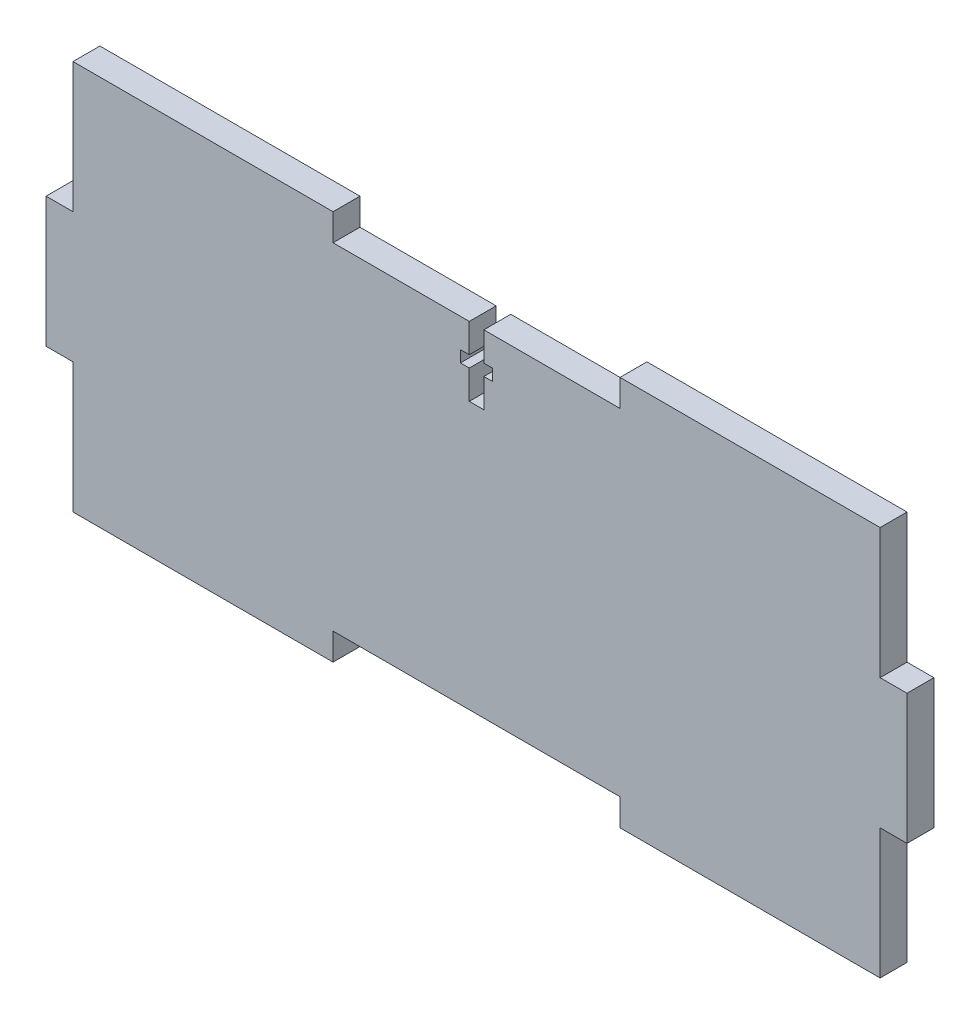
ISO-10303-21;
HEADER;
FILE_DESCRIPTION(('STEP AP214'),'2;1');
FILE_NAME('part.step','',(''),(''),'','','');
FILE_SCHEMA(('AUTOMOTIVE_DESIGN { 1 0 10303 214 1 1 1 1 }'));
ENDSEC;
DATA;
#1=APPLICATION_CONTEXT('core data for automotive mechanical design processes');
#2=APPLICATION_PROTOCOL_DEFINITION('international standard','automotive_design',2000,#1);
#3=PRODUCT_CONTEXT('',#1,'mechanical');
#4=PRODUCT('Part','Part','',(#3));
#5=PRODUCT_RELATED_PRODUCT_CATEGORY('part','',(#4));
#6=PRODUCT_DEFINITION_FORMATION('','',#4);
#7=PRODUCT_DEFINITION_CONTEXT('part definition',#1,'design');
#8=PRODUCT_DEFINITION('design','',#6,#7);
#9=PRODUCT_DEFINITION_SHAPE('','',#8);
#10=(LENGTH_UNIT() NAMED_UNIT(*) SI_UNIT(.MILLI.,.METRE.));
#11=(NAMED_UNIT(*) PLANE_ANGLE_UNIT() SI_UNIT($,.RADIAN.));
#12=(NAMED_UNIT(*) SI_UNIT($,.STERADIAN.) SOLID_ANGLE_UNIT());
#13=UNCERTAINTY_MEASURE_WITH_UNIT(LENGTH_MEASURE(1.E-05),#10,'distance_accuracy_value','');
#14=(GEOMETRIC_REPRESENTATION_CONTEXT(3) GLOBAL_UNCERTAINTY_ASSIGNED_CONTEXT((#13)) GLOBAL_UNIT_ASSIGNED_CONTEXT((#10,
#11,#12)) REPRESENTATION_CONTEXT('',''));
#15=CARTESIAN_POINT('',(0.,0.,0.));
#16=DIRECTION('',(0.,0.,1.));
#17=DIRECTION('',(1.,0.,0.));
#18=AXIS2_PLACEMENT_3D('',#15,#16,#17);
#19=CARTESIAN_POINT('',(-81.28,-36.83,5.08));
#20=DIRECTION('',(0.,1.,0.));
#21=DIRECTION('',(0.,0.,1.));
#22=AXIS2_PLACEMENT_3D('',#19,#20,#21);
#23=PLANE('',#22);
#24=DIRECTION('',(0.,0.,-1.));
#25=VECTOR('',#24,1.);
#26=CARTESIAN_POINT('',(-76.2,-36.83,5.08));
#27=LINE('',#26,#25);
#28=CARTESIAN_POINT('',(-76.2,-36.83,5.08));
#29=VERTEX_POINT('',#28);
#30=CARTESIAN_POINT('',(-76.2,-36.83,0.));
#31=VERTEX_POINT('',#30);
#32=EDGE_CURVE('E375',#29,#31,#27,.T.);
#33=ORIENTED_EDGE('',*,*,#32,.T.);
#34=DIRECTION('',(1.,0.,0.));
#35=VECTOR('',#34,1.);
#36=CARTESIAN_POINT('',(-81.28,-36.83,0.));
#37=LINE('',#36,#35);
#38=CARTESIAN_POINT('',(-27.0933333333333,-36.83,0.));
#39=VERTEX_POINT('',#38);
#40=EDGE_CURVE('E284',#31,#39,#37,.T.);
#41=ORIENTED_EDGE('',*,*,#40,.T.);
#42=DIRECTION('',(0.,0.,1.));
#43=VECTOR('',#42,1.);
#44=CARTESIAN_POINT('',(-27.0933333333333,-36.83,0.));
#45=LINE('',#44,#43);
#46=CARTESIAN_POINT('',(-27.0933333333333,-36.83,5.08));
#47=VERTEX_POINT('',#46);
#48=EDGE_CURVE('E340',#39,#47,#45,.T.);
#49=ORIENTED_EDGE('',*,*,#48,.T.);
#50=DIRECTION('',(1.,0.,0.));
#51=VECTOR('',#50,1.);
#52=CARTESIAN_POINT('',(-81.28,-36.83,5.08));
#53=LINE('',#52,#51);
#54=EDGE_CURVE('E268',#29,#47,#53,.T.);
#55=ORIENTED_EDGE('',*,*,#54,.F.);
#56=EDGE_LOOP('',(#33,#41,#49,#55));
#57=FACE_BOUND('',#56,.T.);
#58=ADVANCED_FACE('F33',(#57),#23,.F.);
#59=CARTESIAN_POINT('',(-81.28,36.83,5.08));
#60=DIRECTION('',(0.,-1.,0.));
#61=DIRECTION('',(0.,0.,-1.));
#62=AXIS2_PLACEMENT_3D('',#59,#60,#61);
#63=PLANE('',#62);
#64=DIRECTION('',(0.,0.,1.));
#65=VECTOR('',#64,1.);
#66=CARTESIAN_POINT('',(-76.2,36.83,5.08));
#67=LINE('',#66,#65);
#68=CARTESIAN_POINT('',(-76.2,36.83,0.));
#69=VERTEX_POINT('',#68);
#70=CARTESIAN_POINT('',(-76.2,36.83,5.08));
#71=VERTEX_POINT('',#70);
#72=EDGE_CURVE('E366',#69,#71,#67,.T.);
#73=ORIENTED_EDGE('',*,*,#72,.T.);
#74=DIRECTION('',(-1.,0.,0.));
#75=VECTOR('',#74,1.);
#76=CARTESIAN_POINT('',(-81.28,36.83,5.08));
#77=LINE('',#76,#75);
#78=CARTESIAN_POINT('',(-27.0933333333333,36.83,5.08));
#79=VERTEX_POINT('',#78);
#80=EDGE_CURVE('E270',#79,#71,#77,.T.);
#81=ORIENTED_EDGE('',*,*,#80,.F.);
#82=DIRECTION('',(0.,0.,1.));
#83=VECTOR('',#82,1.);
#84=CARTESIAN_POINT('',(-27.0933333333333,36.83,0.));
#85=LINE('',#84,#83);
#86=CARTESIAN_POINT('',(-27.0933333333333,36.83,0.));
#87=VERTEX_POINT('',#86);
#88=EDGE_CURVE('E279',#87,#79,#85,.T.);
#89=ORIENTED_EDGE('',*,*,#88,.F.);
#90=DIRECTION('',(-1.,0.,0.));
#91=VECTOR('',#90,1.);
#92=CARTESIAN_POINT('',(-81.28,36.83,0.));
#93=LINE('',#92,#91);
#94=EDGE_CURVE('E278',#87,#69,#93,.T.);
#95=ORIENTED_EDGE('',*,*,#94,.T.);
#96=EDGE_LOOP('',(#73,#81,#89,#95));
#97=FACE_BOUND('',#96,.T.);
#98=ADVANCED_FACE('F363',(#97),#63,.F.);
#99=CARTESIAN_POINT('',(-81.28,-36.83,5.08));
#100=DIRECTION('',(1.,0.,0.));
#101=DIRECTION('',(0.,0.,-1.));
#102=AXIS2_PLACEMENT_3D('',#99,#100,#101);
#103=PLANE('',#102);
#104=DIRECTION('',(0.,0.,1.));
#105=VECTOR('',#104,1.);
#106=CARTESIAN_POINT('',(-81.28,12.2766666666667,5.08));
#107=LINE('',#106,#105);
#108=CARTESIAN_POINT('',(-81.28,12.2766666666667,0.));
#109=VERTEX_POINT('',#108);
#110=CARTESIAN_POINT('',(-81.28,12.2766666666667,5.08));
#111=VERTEX_POINT('',#110);
#112=EDGE_CURVE('E249',#109,#111,#107,.T.);
#113=ORIENTED_EDGE('',*,*,#112,.F.);
#114=DIRECTION('',(0.,-1.,0.));
#115=VECTOR('',#114,1.);
#116=CARTESIAN_POINT('',(-81.28,-36.83,0.));
#117=LINE('',#116,#115);
#118=CARTESIAN_POINT('',(-81.28,-12.2766666666667,0.));
#119=VERTEX_POINT('',#118);
#120=EDGE_CURVE('E258',#109,#119,#117,.T.);
#121=ORIENTED_EDGE('',*,*,#120,.T.);
#122=DIRECTION('',(0.,0.,-1.));
#123=VECTOR('',#122,1.);
#124=CARTESIAN_POINT('',(-81.28,-12.2766666666667,5.08));
#125=LINE('',#124,#123);
#126=CARTESIAN_POINT('',(-81.28,-12.2766666666667,5.08));
#127=VERTEX_POINT('',#126);
#128=EDGE_CURVE('E56',#127,#119,#125,.T.);
#129=ORIENTED_EDGE('',*,*,#128,.F.);
#130=DIRECTION('',(0.,-1.,0.));
#131=VECTOR('',#130,1.);
#132=CARTESIAN_POINT('',(-81.28,-36.83,5.08));
#133=LINE('',#132,#131);
#134=EDGE_CURVE('E256',#111,#127,#133,.T.);
#135=ORIENTED_EDGE('',*,*,#134,.F.);
#136=EDGE_LOOP('',(#113,#121,#129,#135));
#137=FACE_BOUND('',#136,.T.);
#138=ADVANCED_FACE('F255',(#137),#103,.F.);
#139=CARTESIAN_POINT('',(0.,0.,5.08));
#140=DIRECTION('',(0.,0.,-1.));
#141=DIRECTION('',(-1.,0.,0.));
#142=AXIS2_PLACEMENT_3D('',#139,#140,#141);
#143=PLANE('',#142);
#144=DIRECTION('',(0.,-1.,0.));
#145=VECTOR('',#144,1.);
#146=CARTESIAN_POINT('',(-76.2,-36.83,5.08));
#147=LINE('',#146,#145);
#148=CARTESIAN_POINT('',(-76.2,12.2766666666667,5.08));
#149=VERTEX_POINT('',#148);
#150=EDGE_CURVE('E358',#71,#149,#147,.T.);
#151=ORIENTED_EDGE('',*,*,#150,.T.);
#152=DIRECTION('',(1.,0.,0.));
#153=VECTOR('',#152,1.);
#154=CARTESIAN_POINT('',(-81.28,12.2766666666667,5.08));
#155=LINE('',#154,#153);
#156=EDGE_CURVE('E263',#111,#149,#155,.T.);
#157=ORIENTED_EDGE('',*,*,#156,.F.);
#158=ORIENTED_EDGE('',*,*,#134,.T.);
#159=DIRECTION('',(1.,0.,0.));
#160=VECTOR('',#159,1.);
#161=CARTESIAN_POINT('',(-81.28,-12.2766666666667,5.08));
#162=LINE('',#161,#160);
#163=CARTESIAN_POINT('',(-76.2,-12.2766666666667,5.08));
#164=VERTEX_POINT('',#163);
#165=EDGE_CURVE('E240',#127,#164,#162,.T.);
#166=ORIENTED_EDGE('',*,*,#165,.T.);
#167=EDGE_CURVE('E368',#164,#29,#147,.T.);
#168=ORIENTED_EDGE('',*,*,#167,.T.);
#169=ORIENTED_EDGE('',*,*,#54,.T.);
#170=DIRECTION('',(0.,-1.,0.));
#171=VECTOR('',#170,1.);
#172=CARTESIAN_POINT('',(-27.0933333333333,-36.83,5.08));
#173=LINE('',#172,#171);
#174=CARTESIAN_POINT('',(-27.0933333333333,-31.75,5.08));
#175=VERTEX_POINT('',#174);
#176=EDGE_CURVE('E477',#175,#47,#173,.T.);
#177=ORIENTED_EDGE('',*,*,#176,.F.);
#178=DIRECTION('',(-1.,0.,0.));
#179=VECTOR('',#178,1.);
#180=CARTESIAN_POINT('',(-27.0933333333333,-31.75,5.08));
#181=LINE('',#180,#179);
#182=CARTESIAN_POINT('',(27.0933333333333,-31.75,5.08));
#183=VERTEX_POINT('',#182);
#184=EDGE_CURVE('E486',#183,#175,#181,.T.);
#185=ORIENTED_EDGE('',*,*,#184,.F.);
#186=DIRECTION('',(0.,1.,0.));
#187=VECTOR('',#186,1.);
#188=CARTESIAN_POINT('',(27.0933333333333,-36.83,5.08));
#189=LINE('',#188,#187);
#190=CARTESIAN_POINT('',(27.0933333333333,-36.83,5.08));
#191=VERTEX_POINT('',#190);
#192=EDGE_CURVE('E465',#191,#183,#189,.T.);
#193=ORIENTED_EDGE('',*,*,#192,.F.);
#194=CARTESIAN_POINT('',(76.2,-36.83,5.08));
#195=VERTEX_POINT('',#194);
#196=EDGE_CURVE('E264',#191,#195,#53,.T.);
#197=ORIENTED_EDGE('',*,*,#196,.T.);
#198=DIRECTION('',(0.,-1.,0.));
#199=VECTOR('',#198,1.);
#200=CARTESIAN_POINT('',(76.2,-36.83,5.08));
#201=LINE('',#200,#199);
#202=CARTESIAN_POINT('',(76.2,-12.2766666666667,5.08));
#203=VERTEX_POINT('',#202);
#204=EDGE_CURVE('E315',#203,#195,#201,.T.);
#205=ORIENTED_EDGE('',*,*,#204,.F.);
#206=DIRECTION('',(1.,0.,0.));
#207=VECTOR('',#206,1.);
#208=CARTESIAN_POINT('',(76.2,-12.2766666666667,5.08));
#209=LINE('',#208,#207);
#210=CARTESIAN_POINT('',(81.28,-12.2766666666667,5.08));
#211=VERTEX_POINT('',#210);
#212=EDGE_CURVE('E383',#203,#211,#209,.T.);
#213=ORIENTED_EDGE('',*,*,#212,.T.);
#214=DIRECTION('',(0.,1.,0.));
#215=VECTOR('',#214,1.);
#216=CARTESIAN_POINT('',(81.28,-36.83,5.08));
#217=LINE('',#216,#215);
#218=CARTESIAN_POINT('',(81.28,12.2766666666667,5.08));
#219=VERTEX_POINT('',#218);
#220=EDGE_CURVE('E286',#211,#219,#217,.T.);
#221=ORIENTED_EDGE('',*,*,#220,.T.);
#222=DIRECTION('',(1.,0.,0.));
#223=VECTOR('',#222,1.);
#224=CARTESIAN_POINT('',(76.2,12.2766666666667,5.08));
#225=LINE('',#224,#223);
#226=CARTESIAN_POINT('',(76.2,12.2766666666667,5.08));
#227=VERTEX_POINT('',#226);
#228=EDGE_CURVE('E316',#227,#219,#225,.T.);
#229=ORIENTED_EDGE('',*,*,#228,.F.);
#230=CARTESIAN_POINT('',(76.2,36.83,5.08));
#231=VERTEX_POINT('',#230);
#232=EDGE_CURVE('E394',#231,#227,#201,.T.);
#233=ORIENTED_EDGE('',*,*,#232,.F.);
#234=CARTESIAN_POINT('',(27.0933333333333,36.83,5.08));
#235=VERTEX_POINT('',#234);
#236=EDGE_CURVE('E265',#231,#235,#77,.T.);
#237=ORIENTED_EDGE('',*,*,#236,.T.);
#238=DIRECTION('',(0.,1.,0.));
#239=VECTOR('',#238,1.);
#240=CARTESIAN_POINT('',(27.0933333333333,36.83,5.08));
#241=LINE('',#240,#239);
#242=CARTESIAN_POINT('',(27.0933333333333,31.75,5.08));
#243=VERTEX_POINT('',#242);
#244=EDGE_CURVE('E344',#243,#235,#241,.T.);
#245=ORIENTED_EDGE('',*,*,#244,.F.);
#246=DIRECTION('',(1.,0.,0.));
#247=VECTOR('',#246,1.);
#248=CARTESIAN_POINT('',(-27.0933333333333,31.75,5.08));
#249=LINE('',#248,#247);
#250=CARTESIAN_POINT('',(1.37795,31.75,5.08));
#251=VERTEX_POINT('',#250);
#252=EDGE_CURVE('E339',#251,#243,#249,.T.);
#253=ORIENTED_EDGE('',*,*,#252,.F.);
#254=DIRECTION('',(0.,1.,0.));
#255=VECTOR('',#254,1.);
#256=CARTESIAN_POINT('',(1.37795,31.75,5.08));
#257=LINE('',#256,#255);
#258=CARTESIAN_POINT('',(1.37795,26.29535,5.08));
#259=VERTEX_POINT('',#258);
#260=EDGE_CURVE('E459',#259,#251,#257,.T.);
#261=ORIENTED_EDGE('',*,*,#260,.F.);
#262=DIRECTION('',(-1.,0.,0.));
#263=VECTOR('',#262,1.);
#264=CARTESIAN_POINT('',(-3.048,26.29535,5.08));
#265=LINE('',#264,#263);
#266=CARTESIAN_POINT('',(3.048,26.29535,5.08));
#267=VERTEX_POINT('',#266);
#268=EDGE_CURVE('E403',#267,#259,#265,.T.);
#269=ORIENTED_EDGE('',*,*,#268,.F.);
#270=DIRECTION('',(0.,1.,0.));
#271=VECTOR('',#270,1.);
#272=CARTESIAN_POINT('',(3.048,26.29535,5.08));
#273=LINE('',#272,#271);
#274=CARTESIAN_POINT('',(3.048,24.12365,5.08));
#275=VERTEX_POINT('',#274);
#276=EDGE_CURVE('E420',#275,#267,#273,.T.);
#277=ORIENTED_EDGE('',*,*,#276,.F.);
#278=DIRECTION('',(1.,0.,0.));
#279=VECTOR('',#278,1.);
#280=CARTESIAN_POINT('',(-3.048,24.12365,5.08));
#281=LINE('',#280,#279);
#282=CARTESIAN_POINT('',(1.37795,24.12365,5.08));
#283=VERTEX_POINT('',#282);
#284=EDGE_CURVE('E417',#283,#275,#281,.T.);
#285=ORIENTED_EDGE('',*,*,#284,.F.);
#286=CARTESIAN_POINT('',(1.37795,18.669,5.08));
#287=VERTEX_POINT('',#286);
#288=EDGE_CURVE('E460',#287,#283,#257,.T.);
#289=ORIENTED_EDGE('',*,*,#288,.F.);
#290=DIRECTION('',(1.,0.,0.));
#291=VECTOR('',#290,1.);
#292=CARTESIAN_POINT('',(-1.37795,18.669,5.08));
#293=LINE('',#292,#291);
#294=CARTESIAN_POINT('',(-1.37795,18.669,5.08));
#295=VERTEX_POINT('',#294);
#296=EDGE_CURVE('E456',#295,#287,#293,.T.);
#297=ORIENTED_EDGE('',*,*,#296,.F.);
#298=DIRECTION('',(0.,-1.,0.));
#299=VECTOR('',#298,1.);
#300=CARTESIAN_POINT('',(-1.37795,31.75,5.08));
#301=LINE('',#300,#299);
#302=CARTESIAN_POINT('',(-1.37795,24.12365,5.08));
#303=VERTEX_POINT('',#302);
#304=EDGE_CURVE('E440',#303,#295,#301,.T.);
#305=ORIENTED_EDGE('',*,*,#304,.F.);
#306=CARTESIAN_POINT('',(-3.048,24.12365,5.08));
#307=VERTEX_POINT('',#306);
#308=EDGE_CURVE('E418',#307,#303,#281,.T.);
#309=ORIENTED_EDGE('',*,*,#308,.F.);
#310=DIRECTION('',(0.,-1.,0.));
#311=VECTOR('',#310,1.);
#312=CARTESIAN_POINT('',(-3.048,26.29535,5.08));
#313=LINE('',#312,#311);
#314=CARTESIAN_POINT('',(-3.048,26.29535,5.08));
#315=VERTEX_POINT('',#314);
#316=EDGE_CURVE('E398',#315,#307,#313,.T.);
#317=ORIENTED_EDGE('',*,*,#316,.F.);
#318=CARTESIAN_POINT('',(-1.37795,26.29535,5.08));
#319=VERTEX_POINT('',#318);
#320=EDGE_CURVE('E423',#319,#315,#265,.T.);
#321=ORIENTED_EDGE('',*,*,#320,.F.);
#322=CARTESIAN_POINT('',(-1.37795,31.75,5.08));
#323=VERTEX_POINT('',#322);
#324=EDGE_CURVE('E453',#323,#319,#301,.T.);
#325=ORIENTED_EDGE('',*,*,#324,.F.);
#326=CARTESIAN_POINT('',(-27.0933333333333,31.75,5.08));
#327=VERTEX_POINT('',#326);
#328=EDGE_CURVE('E341',#327,#323,#249,.T.);
#329=ORIENTED_EDGE('',*,*,#328,.F.);
#330=DIRECTION('',(0.,-1.,0.));
#331=VECTOR('',#330,1.);
#332=CARTESIAN_POINT('',(-27.0933333333333,36.83,5.08));
#333=LINE('',#332,#331);
#334=EDGE_CURVE('E336',#79,#327,#333,.T.);
#335=ORIENTED_EDGE('',*,*,#334,.F.);
#336=ORIENTED_EDGE('',*,*,#80,.T.);
#337=EDGE_LOOP('',(#151,#157,#158,#166,#168,#169,#177,#185,#193,#197,#205,#213,#221,#229,#233,
#237,#245,#253,#261,#269,#277,#285,#289,#297,#305,#309,#317,#321,#325,#329,#335,#336));
#338=FACE_BOUND('',#337,.T.);
#339=ADVANCED_FACE('F262',(#338),#143,.F.);
#340=CARTESIAN_POINT('',(0.,0.,0.));
#341=DIRECTION('',(0.,0.,-1.));
#342=DIRECTION('',(-1.,0.,0.));
#343=AXIS2_PLACEMENT_3D('',#340,#341,#342);
#344=PLANE('',#343);
#345=ORIENTED_EDGE('',*,*,#120,.F.);
#346=DIRECTION('',(1.,0.,0.));
#347=VECTOR('',#346,1.);
#348=CARTESIAN_POINT('',(-81.28,12.2766666666667,0.));
#349=LINE('',#348,#347);
#350=CARTESIAN_POINT('',(-76.2,12.2766666666667,0.));
#351=VERTEX_POINT('',#350);
#352=EDGE_CURVE('E371',#109,#351,#349,.T.);
#353=ORIENTED_EDGE('',*,*,#352,.T.);
#354=DIRECTION('',(0.,1.,0.));
#355=VECTOR('',#354,1.);
#356=CARTESIAN_POINT('',(-76.2,0.,0.));
#357=LINE('',#356,#355);
#358=EDGE_CURVE('E41',#351,#69,#357,.T.);
#359=ORIENTED_EDGE('',*,*,#358,.T.);
#360=ORIENTED_EDGE('',*,*,#94,.F.);
#361=DIRECTION('',(0.,-1.,0.));
#362=VECTOR('',#361,1.);
#363=CARTESIAN_POINT('',(-27.0933333333333,36.83,0.));
#364=LINE('',#363,#362);
#365=CARTESIAN_POINT('',(-27.0933333333333,31.75,0.));
#366=VERTEX_POINT('',#365);
#367=EDGE_CURVE('E347',#87,#366,#364,.T.);
#368=ORIENTED_EDGE('',*,*,#367,.T.);
#369=DIRECTION('',(1.,0.,0.));
#370=VECTOR('',#369,1.);
#371=CARTESIAN_POINT('',(-27.0933333333333,31.75,0.));
#372=LINE('',#371,#370);
#373=CARTESIAN_POINT('',(-1.37795,31.75,0.));
#374=VERTEX_POINT('',#373);
#375=EDGE_CURVE('E328',#366,#374,#372,.T.);
#376=ORIENTED_EDGE('',*,*,#375,.T.);
#377=DIRECTION('',(0.,-1.,0.));
#378=VECTOR('',#377,1.);
#379=CARTESIAN_POINT('',(-1.37795,31.75,0.));
#380=LINE('',#379,#378);
#381=CARTESIAN_POINT('',(-1.37795,26.29535,0.));
#382=VERTEX_POINT('',#381);
#383=EDGE_CURVE('E441',#374,#382,#380,.T.);
#384=ORIENTED_EDGE('',*,*,#383,.T.);
#385=DIRECTION('',(-1.,0.,0.));
#386=VECTOR('',#385,1.);
#387=CARTESIAN_POINT('',(-3.048,26.29535,0.));
#388=LINE('',#387,#386);
#389=CARTESIAN_POINT('',(-3.048,26.29535,0.));
#390=VERTEX_POINT('',#389);
#391=EDGE_CURVE('E410',#382,#390,#388,.T.);
#392=ORIENTED_EDGE('',*,*,#391,.T.);
#393=DIRECTION('',(0.,-1.,0.));
#394=VECTOR('',#393,1.);
#395=CARTESIAN_POINT('',(-3.048,26.29535,0.));
#396=LINE('',#395,#394);
#397=CARTESIAN_POINT('',(-3.048,24.12365,0.));
#398=VERTEX_POINT('',#397);
#399=EDGE_CURVE('E399',#390,#398,#396,.T.);
#400=ORIENTED_EDGE('',*,*,#399,.T.);
#401=DIRECTION('',(1.,0.,0.));
#402=VECTOR('',#401,1.);
#403=CARTESIAN_POINT('',(-3.048,24.12365,0.));
#404=LINE('',#403,#402);
#405=CARTESIAN_POINT('',(-1.37795,24.12365,0.));
#406=VERTEX_POINT('',#405);
#407=EDGE_CURVE('E404',#398,#406,#404,.T.);
#408=ORIENTED_EDGE('',*,*,#407,.T.);
#409=CARTESIAN_POINT('',(-1.37795,18.669,0.));
#410=VERTEX_POINT('',#409);
#411=EDGE_CURVE('E445',#406,#410,#380,.T.);
#412=ORIENTED_EDGE('',*,*,#411,.T.);
#413=DIRECTION('',(1.,0.,0.));
#414=VECTOR('',#413,1.);
#415=CARTESIAN_POINT('',(-1.37795,18.669,0.));
#416=LINE('',#415,#414);
#417=CARTESIAN_POINT('',(1.37795,18.669,0.));
#418=VERTEX_POINT('',#417);
#419=EDGE_CURVE('E444',#410,#418,#416,.T.);
#420=ORIENTED_EDGE('',*,*,#419,.T.);
#421=DIRECTION('',(0.,1.,0.));
#422=VECTOR('',#421,1.);
#423=CARTESIAN_POINT('',(1.37795,31.75,0.));
#424=LINE('',#423,#422);
#425=CARTESIAN_POINT('',(1.37795,24.12365,0.));
#426=VERTEX_POINT('',#425);
#427=EDGE_CURVE('E449',#418,#426,#424,.T.);
#428=ORIENTED_EDGE('',*,*,#427,.T.);
#429=CARTESIAN_POINT('',(3.048,24.12365,0.));
#430=VERTEX_POINT('',#429);
#431=EDGE_CURVE('E402',#426,#430,#404,.T.);
#432=ORIENTED_EDGE('',*,*,#431,.T.);
#433=DIRECTION('',(0.,1.,0.));
#434=VECTOR('',#433,1.);
#435=CARTESIAN_POINT('',(3.048,26.29535,0.));
#436=LINE('',#435,#434);
#437=CARTESIAN_POINT('',(3.048,26.29535,0.));
#438=VERTEX_POINT('',#437);
#439=EDGE_CURVE('E407',#430,#438,#436,.T.);
#440=ORIENTED_EDGE('',*,*,#439,.T.);
#441=CARTESIAN_POINT('',(1.37795,26.29535,0.));
#442=VERTEX_POINT('',#441);
#443=EDGE_CURVE('E411',#438,#442,#388,.T.);
#444=ORIENTED_EDGE('',*,*,#443,.T.);
#445=CARTESIAN_POINT('',(1.37795,31.75,0.));
#446=VERTEX_POINT('',#445);
#447=EDGE_CURVE('E448',#442,#446,#424,.T.);
#448=ORIENTED_EDGE('',*,*,#447,.T.);
#449=CARTESIAN_POINT('',(27.0933333333333,31.75,0.));
#450=VERTEX_POINT('',#449);
#451=EDGE_CURVE('E323',#446,#450,#372,.T.);
#452=ORIENTED_EDGE('',*,*,#451,.T.);
#453=DIRECTION('',(0.,1.,0.));
#454=VECTOR('',#453,1.);
#455=CARTESIAN_POINT('',(27.0933333333333,36.83,0.));
#456=LINE('',#455,#454);
#457=CARTESIAN_POINT('',(27.0933333333333,36.83,0.));
#458=VERTEX_POINT('',#457);
#459=EDGE_CURVE('E321',#450,#458,#456,.T.);
#460=ORIENTED_EDGE('',*,*,#459,.T.);
#461=CARTESIAN_POINT('',(76.2,36.83,0.));
#462=VERTEX_POINT('',#461);
#463=EDGE_CURVE('E280',#462,#458,#93,.T.);
#464=ORIENTED_EDGE('',*,*,#463,.F.);
#465=DIRECTION('',(0.,1.,0.));
#466=VECTOR('',#465,1.);
#467=CARTESIAN_POINT('',(76.2,0.,0.));
#468=LINE('',#467,#466);
#469=CARTESIAN_POINT('',(76.2,12.2766666666667,0.));
#470=VERTEX_POINT('',#469);
#471=EDGE_CURVE('E291',#470,#462,#468,.T.);
#472=ORIENTED_EDGE('',*,*,#471,.F.);
#473=DIRECTION('',(1.,0.,0.));
#474=VECTOR('',#473,1.);
#475=CARTESIAN_POINT('',(76.2,12.2766666666667,0.));
#476=LINE('',#475,#474);
#477=CARTESIAN_POINT('',(81.28,12.2766666666667,0.));
#478=VERTEX_POINT('',#477);
#479=EDGE_CURVE('E389',#470,#478,#476,.T.);
#480=ORIENTED_EDGE('',*,*,#479,.T.);
#481=DIRECTION('',(0.,1.,0.));
#482=VECTOR('',#481,1.);
#483=CARTESIAN_POINT('',(81.28,-36.83,0.));
#484=LINE('',#483,#482);
#485=CARTESIAN_POINT('',(81.28,-12.2766666666667,0.));
#486=VERTEX_POINT('',#485);
#487=EDGE_CURVE('E275',#486,#478,#484,.T.);
#488=ORIENTED_EDGE('',*,*,#487,.F.);
#489=DIRECTION('',(1.,0.,0.));
#490=VECTOR('',#489,1.);
#491=CARTESIAN_POINT('',(76.2,-12.2766666666667,0.));
#492=LINE('',#491,#490);
#493=CARTESIAN_POINT('',(76.2,-12.2766666666667,0.));
#494=VERTEX_POINT('',#493);
#495=EDGE_CURVE('E391',#494,#486,#492,.T.);
#496=ORIENTED_EDGE('',*,*,#495,.F.);
#497=CARTESIAN_POINT('',(76.2,-36.83,0.));
#498=VERTEX_POINT('',#497);
#499=EDGE_CURVE('E292',#498,#494,#468,.T.);
#500=ORIENTED_EDGE('',*,*,#499,.F.);
#501=CARTESIAN_POINT('',(27.0933333333333,-36.83,0.));
#502=VERTEX_POINT('',#501);
#503=EDGE_CURVE('E283',#502,#498,#37,.T.);
#504=ORIENTED_EDGE('',*,*,#503,.F.);
#505=DIRECTION('',(0.,1.,0.));
#506=VECTOR('',#505,1.);
#507=CARTESIAN_POINT('',(27.0933333333333,-36.83,0.));
#508=LINE('',#507,#506);
#509=CARTESIAN_POINT('',(27.0933333333333,-31.75,0.));
#510=VERTEX_POINT('',#509);
#511=EDGE_CURVE('E473',#502,#510,#508,.T.);
#512=ORIENTED_EDGE('',*,*,#511,.T.);
#513=DIRECTION('',(-1.,0.,0.));
#514=VECTOR('',#513,1.);
#515=CARTESIAN_POINT('',(-27.0933333333333,-31.75,0.));
#516=LINE('',#515,#514);
#517=CARTESIAN_POINT('',(-27.0933333333333,-31.75,0.));
#518=VERTEX_POINT('',#517);
#519=EDGE_CURVE('E476',#510,#518,#516,.T.);
#520=ORIENTED_EDGE('',*,*,#519,.T.);
#521=DIRECTION('',(0.,-1.,0.));
#522=VECTOR('',#521,1.);
#523=CARTESIAN_POINT('',(-27.0933333333333,-36.83,0.));
#524=LINE('',#523,#522);
#525=EDGE_CURVE('E480',#518,#39,#524,.T.);
#526=ORIENTED_EDGE('',*,*,#525,.T.);
#527=ORIENTED_EDGE('',*,*,#40,.F.);
#528=CARTESIAN_POINT('',(-76.2,-12.2766666666667,0.));
#529=VERTEX_POINT('',#528);
#530=EDGE_CURVE('E11',#31,#529,#357,.T.);
#531=ORIENTED_EDGE('',*,*,#530,.T.);
#532=DIRECTION('',(1.,0.,0.));
#533=VECTOR('',#532,1.);
#534=CARTESIAN_POINT('',(-81.28,-12.2766666666667,0.));
#535=LINE('',#534,#533);
#536=EDGE_CURVE('E248',#119,#529,#535,.T.);
#537=ORIENTED_EDGE('',*,*,#536,.F.);
#538=EDGE_LOOP('',(#345,#353,#359,#360,#368,#376,#384,#392,#400,#408,#412,#420,#428,#432,#440,
#444,#448,#452,#460,#464,#472,#480,#488,#496,#500,#504,#512,#520,#526,#527,#531,#537));
#539=FACE_BOUND('',#538,.T.);
#540=ADVANCED_FACE('F319',(#539),#344,.T.);
#541=CARTESIAN_POINT('',(81.28,-36.83,5.08));
#542=DIRECTION('',(-1.,0.,0.));
#543=DIRECTION('',(0.,0.,1.));
#544=AXIS2_PLACEMENT_3D('',#541,#542,#543);
#545=PLANE('',#544);
#546=DIRECTION('',(0.,0.,1.));
#547=VECTOR('',#546,1.);
#548=CARTESIAN_POINT('',(81.28,12.2766666666667,5.08));
#549=LINE('',#548,#547);
#550=EDGE_CURVE('E381',#478,#219,#549,.T.);
#551=ORIENTED_EDGE('',*,*,#550,.T.);
#552=ORIENTED_EDGE('',*,*,#220,.F.);
#553=DIRECTION('',(0.,0.,-1.));
#554=VECTOR('',#553,1.);
#555=CARTESIAN_POINT('',(81.28,-12.2766666666667,5.08));
#556=LINE('',#555,#554);
#557=EDGE_CURVE('E378',#211,#486,#556,.T.);
#558=ORIENTED_EDGE('',*,*,#557,.T.);
#559=ORIENTED_EDGE('',*,*,#487,.T.);
#560=EDGE_LOOP('',(#551,#552,#558,#559));
#561=FACE_BOUND('',#560,.T.);
#562=ADVANCED_FACE('F35',(#561),#545,.F.);
#563=CARTESIAN_POINT('',(-1.37795,31.75,0.));
#564=DIRECTION('',(-1.,0.,0.));
#565=DIRECTION('',(0.,-1.,0.));
#566=AXIS2_PLACEMENT_3D('',#563,#564,#565);
#567=PLANE('',#566);
#568=ORIENTED_EDGE('',*,*,#324,.T.);
#569=DIRECTION('',(0.,0.,-1.));
#570=VECTOR('',#569,1.);
#571=CARTESIAN_POINT('',(-1.37795,26.29535,0.));
#572=LINE('',#571,#570);
#573=EDGE_CURVE('E437',#319,#382,#572,.T.);
#574=ORIENTED_EDGE('',*,*,#573,.T.);
#575=ORIENTED_EDGE('',*,*,#383,.F.);
#576=DIRECTION('',(0.,0.,1.));
#577=VECTOR('',#576,1.);
#578=CARTESIAN_POINT('',(-1.37795,31.75,0.));
#579=LINE('',#578,#577);
#580=EDGE_CURVE('E463',#374,#323,#579,.T.);
#581=ORIENTED_EDGE('',*,*,#580,.T.);
#582=EDGE_LOOP('',(#568,#574,#575,#581));
#583=FACE_BOUND('',#582,.T.);
#584=ADVANCED_FACE('F506',(#583),#567,.F.);
#585=CARTESIAN_POINT('',(1.37795,31.75,0.));
#586=DIRECTION('',(1.,0.,0.));
#587=DIRECTION('',(0.,1.,0.));
#588=AXIS2_PLACEMENT_3D('',#585,#586,#587);
#589=PLANE('',#588);
#590=ORIENTED_EDGE('',*,*,#447,.F.);
#591=DIRECTION('',(0.,0.,1.));
#592=VECTOR('',#591,1.);
#593=CARTESIAN_POINT('',(1.37795,26.29535,0.));
#594=LINE('',#593,#592);
#595=EDGE_CURVE('E289',#442,#259,#594,.T.);
#596=ORIENTED_EDGE('',*,*,#595,.T.);
#597=ORIENTED_EDGE('',*,*,#260,.T.);
#598=DIRECTION('',(0.,0.,1.));
#599=VECTOR('',#598,1.);
#600=CARTESIAN_POINT('',(1.37795,31.75,0.));
#601=LINE('',#600,#599);
#602=EDGE_CURVE('E466',#446,#251,#601,.T.);
#603=ORIENTED_EDGE('',*,*,#602,.F.);
#604=EDGE_LOOP('',(#590,#596,#597,#603));
#605=FACE_BOUND('',#604,.T.);
#606=ADVANCED_FACE('F546',(#605),#589,.F.);
#607=CARTESIAN_POINT('',(-27.0933333333333,31.75,0.));
#608=DIRECTION('',(0.,-1.,0.));
#609=DIRECTION('',(0.,0.,-1.));
#610=AXIS2_PLACEMENT_3D('',#607,#608,#609);
#611=PLANE('',#610);
#612=ORIENTED_EDGE('',*,*,#328,.T.);
#613=ORIENTED_EDGE('',*,*,#580,.F.);
#614=ORIENTED_EDGE('',*,*,#375,.F.);
#615=DIRECTION('',(0.,0.,1.));
#616=VECTOR('',#615,1.);
#617=CARTESIAN_POINT('',(-27.0933333333333,31.75,0.));
#618=LINE('',#617,#616);
#619=EDGE_CURVE('E327',#366,#327,#618,.T.);
#620=ORIENTED_EDGE('',*,*,#619,.T.);
#621=EDGE_LOOP('',(#612,#613,#614,#620));
#622=FACE_BOUND('',#621,.T.);
#623=ADVANCED_FACE('F503',(#622),#611,.F.);
#624=ORIENTED_EDGE('',*,*,#236,.F.);
#625=DIRECTION('',(0.,0.,1.));
#626=VECTOR('',#625,1.);
#627=CARTESIAN_POINT('',(76.2,36.83,5.08));
#628=LINE('',#627,#626);
#629=EDGE_CURVE('E304',#462,#231,#628,.T.);
#630=ORIENTED_EDGE('',*,*,#629,.F.);
#631=ORIENTED_EDGE('',*,*,#463,.T.);
#632=DIRECTION('',(0.,0.,1.));
#633=VECTOR('',#632,1.);
#634=CARTESIAN_POINT('',(27.0933333333333,36.83,0.));
#635=LINE('',#634,#633);
#636=EDGE_CURVE('E349',#458,#235,#635,.T.);
#637=ORIENTED_EDGE('',*,*,#636,.T.);
#638=EDGE_LOOP('',(#624,#630,#631,#637));
#639=FACE_BOUND('',#638,.T.);
#640=ADVANCED_FACE('F312',(#639),#63,.F.);
#641=ORIENTED_EDGE('',*,*,#503,.T.);
#642=DIRECTION('',(0.,0.,-1.));
#643=VECTOR('',#642,1.);
#644=CARTESIAN_POINT('',(76.2,-36.83,5.08));
#645=LINE('',#644,#643);
#646=EDGE_CURVE('E396',#195,#498,#645,.T.);
#647=ORIENTED_EDGE('',*,*,#646,.F.);
#648=ORIENTED_EDGE('',*,*,#196,.F.);
#649=DIRECTION('',(0.,0.,1.));
#650=VECTOR('',#649,1.);
#651=CARTESIAN_POINT('',(27.0933333333333,-36.83,0.));
#652=LINE('',#651,#650);
#653=EDGE_CURVE('E483',#502,#191,#652,.T.);
#654=ORIENTED_EDGE('',*,*,#653,.F.);
#655=EDGE_LOOP('',(#641,#647,#648,#654));
#656=FACE_BOUND('',#655,.T.);
#657=ADVANCED_FACE('F566',(#656),#23,.F.);
#658=CARTESIAN_POINT('',(-27.0933333333333,36.83,0.));
#659=DIRECTION('',(-1.,0.,0.));
#660=DIRECTION('',(0.,0.,1.));
#661=AXIS2_PLACEMENT_3D('',#658,#659,#660);
#662=PLANE('',#661);
#663=ORIENTED_EDGE('',*,*,#334,.T.);
#664=ORIENTED_EDGE('',*,*,#619,.F.);
#665=ORIENTED_EDGE('',*,*,#367,.F.);
#666=ORIENTED_EDGE('',*,*,#88,.T.);
#667=EDGE_LOOP('',(#663,#664,#665,#666));
#668=FACE_BOUND('',#667,.T.);
#669=ADVANCED_FACE('F500',(#668),#662,.F.);
#670=CARTESIAN_POINT('',(27.0933333333333,36.83,0.));
#671=DIRECTION('',(1.,0.,0.));
#672=DIRECTION('',(0.,0.,-1.));
#673=AXIS2_PLACEMENT_3D('',#670,#671,#672);
#674=PLANE('',#673);
#675=ORIENTED_EDGE('',*,*,#244,.T.);
#676=ORIENTED_EDGE('',*,*,#636,.F.);
#677=ORIENTED_EDGE('',*,*,#459,.F.);
#678=DIRECTION('',(0.,0.,1.));
#679=VECTOR('',#678,1.);
#680=CARTESIAN_POINT('',(27.0933333333333,31.75,0.));
#681=LINE('',#680,#679);
#682=EDGE_CURVE('E330',#450,#243,#681,.T.);
#683=ORIENTED_EDGE('',*,*,#682,.T.);
#684=EDGE_LOOP('',(#675,#676,#677,#683));
#685=FACE_BOUND('',#684,.T.);
#686=ADVANCED_FACE('F551',(#685),#674,.F.);
#687=ORIENTED_EDGE('',*,*,#451,.F.);
#688=ORIENTED_EDGE('',*,*,#602,.T.);
#689=ORIENTED_EDGE('',*,*,#252,.T.);
#690=ORIENTED_EDGE('',*,*,#682,.F.);
#691=EDGE_LOOP('',(#687,#688,#689,#690));
#692=FACE_BOUND('',#691,.T.);
#693=ADVANCED_FACE('F549',(#692),#611,.F.);
#694=CARTESIAN_POINT('',(-27.0933333333333,-36.83,0.));
#695=DIRECTION('',(-1.,0.,0.));
#696=DIRECTION('',(0.,0.,1.));
#697=AXIS2_PLACEMENT_3D('',#694,#695,#696);
#698=PLANE('',#697);
#699=ORIENTED_EDGE('',*,*,#176,.T.);
#700=ORIENTED_EDGE('',*,*,#48,.F.);
#701=ORIENTED_EDGE('',*,*,#525,.F.);
#702=DIRECTION('',(0.,0.,1.));
#703=VECTOR('',#702,1.);
#704=CARTESIAN_POINT('',(-27.0933333333333,-31.75,0.));
#705=LINE('',#704,#703);
#706=EDGE_CURVE('E493',#518,#175,#705,.T.);
#707=ORIENTED_EDGE('',*,*,#706,.T.);
#708=EDGE_LOOP('',(#699,#700,#701,#707));
#709=FACE_BOUND('',#708,.T.);
#710=ADVANCED_FACE('F580',(#709),#698,.F.);
#711=CARTESIAN_POINT('',(-27.0933333333333,-31.75,0.));
#712=DIRECTION('',(0.,1.,0.));
#713=DIRECTION('',(0.,0.,1.));
#714=AXIS2_PLACEMENT_3D('',#711,#712,#713);
#715=PLANE('',#714);
#716=ORIENTED_EDGE('',*,*,#184,.T.);
#717=ORIENTED_EDGE('',*,*,#706,.F.);
#718=ORIENTED_EDGE('',*,*,#519,.F.);
#719=DIRECTION('',(0.,0.,1.));
#720=VECTOR('',#719,1.);
#721=CARTESIAN_POINT('',(27.0933333333333,-31.75,0.));
#722=LINE('',#721,#720);
#723=EDGE_CURVE('E495',#510,#183,#722,.T.);
#724=ORIENTED_EDGE('',*,*,#723,.T.);
#725=EDGE_LOOP('',(#716,#717,#718,#724));
#726=FACE_BOUND('',#725,.T.);
#727=ADVANCED_FACE('F577',(#726),#715,.F.);
#728=CARTESIAN_POINT('',(27.0933333333333,-36.83,0.));
#729=DIRECTION('',(1.,0.,0.));
#730=DIRECTION('',(0.,0.,-1.));
#731=AXIS2_PLACEMENT_3D('',#728,#729,#730);
#732=PLANE('',#731);
#733=ORIENTED_EDGE('',*,*,#192,.T.);
#734=ORIENTED_EDGE('',*,*,#723,.F.);
#735=ORIENTED_EDGE('',*,*,#511,.F.);
#736=ORIENTED_EDGE('',*,*,#653,.T.);
#737=EDGE_LOOP('',(#733,#734,#735,#736));
#738=FACE_BOUND('',#737,.T.);
#739=ADVANCED_FACE('F573',(#738),#732,.F.);
#740=ORIENTED_EDGE('',*,*,#411,.F.);
#741=DIRECTION('',(0.,0.,1.));
#742=VECTOR('',#741,1.);
#743=CARTESIAN_POINT('',(-1.37795,24.12365,0.));
#744=LINE('',#743,#742);
#745=EDGE_CURVE('E428',#406,#303,#744,.T.);
#746=ORIENTED_EDGE('',*,*,#745,.T.);
#747=ORIENTED_EDGE('',*,*,#304,.T.);
#748=DIRECTION('',(0.,0.,1.));
#749=VECTOR('',#748,1.);
#750=CARTESIAN_POINT('',(-1.37795,18.669,0.));
#751=LINE('',#750,#749);
#752=EDGE_CURVE('E452',#410,#295,#751,.T.);
#753=ORIENTED_EDGE('',*,*,#752,.F.);
#754=EDGE_LOOP('',(#740,#746,#747,#753));
#755=FACE_BOUND('',#754,.T.);
#756=ADVANCED_FACE('F521',(#755),#567,.F.);
#757=ORIENTED_EDGE('',*,*,#288,.T.);
#758=DIRECTION('',(0.,0.,-1.));
#759=VECTOR('',#758,1.);
#760=CARTESIAN_POINT('',(1.37795,24.12365,0.));
#761=LINE('',#760,#759);
#762=EDGE_CURVE('E274',#283,#426,#761,.T.);
#763=ORIENTED_EDGE('',*,*,#762,.T.);
#764=ORIENTED_EDGE('',*,*,#427,.F.);
#765=DIRECTION('',(0.,0.,1.));
#766=VECTOR('',#765,1.);
#767=CARTESIAN_POINT('',(1.37795,18.669,0.));
#768=LINE('',#767,#766);
#769=EDGE_CURVE('E469',#418,#287,#768,.T.);
#770=ORIENTED_EDGE('',*,*,#769,.T.);
#771=EDGE_LOOP('',(#757,#763,#764,#770));
#772=FACE_BOUND('',#771,.T.);
#773=ADVANCED_FACE('F530',(#772),#589,.F.);
#774=CARTESIAN_POINT('',(-1.37795,18.669,0.));
#775=DIRECTION('',(0.,-1.,0.));
#776=DIRECTION('',(0.,0.,-1.));
#777=AXIS2_PLACEMENT_3D('',#774,#775,#776);
#778=PLANE('',#777);
#779=ORIENTED_EDGE('',*,*,#296,.T.);
#780=ORIENTED_EDGE('',*,*,#769,.F.);
#781=ORIENTED_EDGE('',*,*,#419,.F.);
#782=ORIENTED_EDGE('',*,*,#752,.T.);
#783=EDGE_LOOP('',(#779,#780,#781,#782));
#784=FACE_BOUND('',#783,.T.);
#785=ADVANCED_FACE('F526',(#784),#778,.F.);
#786=CARTESIAN_POINT('',(-3.048,26.29535,0.));
#787=DIRECTION('',(0.,1.,0.));
#788=DIRECTION('',(0.,0.,1.));
#789=AXIS2_PLACEMENT_3D('',#786,#787,#788);
#790=PLANE('',#789);
#791=ORIENTED_EDGE('',*,*,#443,.F.);
#792=DIRECTION('',(0.,0.,1.));
#793=VECTOR('',#792,1.);
#794=CARTESIAN_POINT('',(3.048,26.29535,0.));
#795=LINE('',#794,#793);
#796=EDGE_CURVE('E429',#438,#267,#795,.T.);
#797=ORIENTED_EDGE('',*,*,#796,.T.);
#798=ORIENTED_EDGE('',*,*,#268,.T.);
#799=ORIENTED_EDGE('',*,*,#595,.F.);
#800=EDGE_LOOP('',(#791,#797,#798,#799));
#801=FACE_BOUND('',#800,.T.);
#802=ADVANCED_FACE('F638',(#801),#790,.F.);
#803=CARTESIAN_POINT('',(-3.048,24.12365,0.));
#804=DIRECTION('',(0.,-1.,0.));
#805=DIRECTION('',(0.,0.,-1.));
#806=AXIS2_PLACEMENT_3D('',#803,#804,#805);
#807=PLANE('',#806);
#808=ORIENTED_EDGE('',*,*,#284,.T.);
#809=DIRECTION('',(0.,0.,1.));
#810=VECTOR('',#809,1.);
#811=CARTESIAN_POINT('',(3.048,24.12365,0.));
#812=LINE('',#811,#810);
#813=EDGE_CURVE('E431',#430,#275,#812,.T.);
#814=ORIENTED_EDGE('',*,*,#813,.F.);
#815=ORIENTED_EDGE('',*,*,#431,.F.);
#816=ORIENTED_EDGE('',*,*,#762,.F.);
#817=EDGE_LOOP('',(#808,#814,#815,#816));
#818=FACE_BOUND('',#817,.T.);
#819=ADVANCED_FACE('F534',(#818),#807,.F.);
#820=CARTESIAN_POINT('',(3.048,26.29535,0.));
#821=DIRECTION('',(1.,0.,0.));
#822=DIRECTION('',(0.,0.,-1.));
#823=AXIS2_PLACEMENT_3D('',#820,#821,#822);
#824=PLANE('',#823);
#825=ORIENTED_EDGE('',*,*,#276,.T.);
#826=ORIENTED_EDGE('',*,*,#796,.F.);
#827=ORIENTED_EDGE('',*,*,#439,.F.);
#828=ORIENTED_EDGE('',*,*,#813,.T.);
#829=EDGE_LOOP('',(#825,#826,#827,#828));
#830=FACE_BOUND('',#829,.T.);
#831=ADVANCED_FACE('F539',(#830),#824,.F.);
#832=ORIENTED_EDGE('',*,*,#320,.T.);
#833=DIRECTION('',(0.,0.,1.));
#834=VECTOR('',#833,1.);
#835=CARTESIAN_POINT('',(-3.048,26.29535,0.));
#836=LINE('',#835,#834);
#837=EDGE_CURVE('E425',#390,#315,#836,.T.);
#838=ORIENTED_EDGE('',*,*,#837,.F.);
#839=ORIENTED_EDGE('',*,*,#391,.F.);
#840=ORIENTED_EDGE('',*,*,#573,.F.);
#841=EDGE_LOOP('',(#832,#838,#839,#840));
#842=FACE_BOUND('',#841,.T.);
#843=ADVANCED_FACE('F511',(#842),#790,.F.);
#844=ORIENTED_EDGE('',*,*,#407,.F.);
#845=DIRECTION('',(0.,0.,1.));
#846=VECTOR('',#845,1.);
#847=CARTESIAN_POINT('',(-3.048,24.12365,0.));
#848=LINE('',#847,#846);
#849=EDGE_CURVE('E414',#398,#307,#848,.T.);
#850=ORIENTED_EDGE('',*,*,#849,.T.);
#851=ORIENTED_EDGE('',*,*,#308,.T.);
#852=ORIENTED_EDGE('',*,*,#745,.F.);
#853=EDGE_LOOP('',(#844,#850,#851,#852));
#854=FACE_BOUND('',#853,.T.);
#855=ADVANCED_FACE('F643',(#854),#807,.F.);
#856=CARTESIAN_POINT('',(-3.048,26.29535,0.));
#857=DIRECTION('',(-1.,0.,0.));
#858=DIRECTION('',(0.,0.,1.));
#859=AXIS2_PLACEMENT_3D('',#856,#857,#858);
#860=PLANE('',#859);
#861=ORIENTED_EDGE('',*,*,#316,.T.);
#862=ORIENTED_EDGE('',*,*,#849,.F.);
#863=ORIENTED_EDGE('',*,*,#399,.F.);
#864=ORIENTED_EDGE('',*,*,#837,.T.);
#865=EDGE_LOOP('',(#861,#862,#863,#864));
#866=FACE_BOUND('',#865,.T.);
#867=ADVANCED_FACE('F514',(#866),#860,.F.);
#868=CARTESIAN_POINT('',(76.2,-12.2766666666667,5.08));
#869=DIRECTION('',(0.,-1.,0.));
#870=DIRECTION('',(-1.,0.,0.));
#871=AXIS2_PLACEMENT_3D('',#868,#869,#870);
#872=PLANE('',#871);
#873=ORIENTED_EDGE('',*,*,#557,.F.);
#874=ORIENTED_EDGE('',*,*,#212,.F.);
#875=DIRECTION('',(0.,0.,-1.));
#876=VECTOR('',#875,1.);
#877=CARTESIAN_POINT('',(76.2,-12.2766666666667,5.08));
#878=LINE('',#877,#876);
#879=EDGE_CURVE('E379',#203,#494,#878,.T.);
#880=ORIENTED_EDGE('',*,*,#879,.T.);
#881=ORIENTED_EDGE('',*,*,#495,.T.);
#882=EDGE_LOOP('',(#873,#874,#880,#881));
#883=FACE_BOUND('',#882,.T.);
#884=ADVANCED_FACE('F559',(#883),#872,.T.);
#885=CARTESIAN_POINT('',(76.2,0.,-110.49));
#886=DIRECTION('',(-1.,0.,0.));
#887=DIRECTION('',(0.,0.,1.));
#888=AXIS2_PLACEMENT_3D('',#885,#886,#887);
#889=PLANE('',#888);
#890=ORIENTED_EDGE('',*,*,#499,.T.);
#891=ORIENTED_EDGE('',*,*,#879,.F.);
#892=ORIENTED_EDGE('',*,*,#204,.T.);
#893=ORIENTED_EDGE('',*,*,#646,.T.);
#894=EDGE_LOOP('',(#890,#891,#892,#893));
#895=FACE_BOUND('',#894,.T.);
#896=ADVANCED_FACE('F562',(#895),#889,.F.);
#897=ORIENTED_EDGE('',*,*,#471,.T.);
#898=ORIENTED_EDGE('',*,*,#629,.T.);
#899=ORIENTED_EDGE('',*,*,#232,.T.);
#900=DIRECTION('',(0.,0.,1.));
#901=VECTOR('',#900,1.);
#902=CARTESIAN_POINT('',(76.2,12.2766666666667,5.08));
#903=LINE('',#902,#901);
#904=EDGE_CURVE('E306',#470,#227,#903,.T.);
#905=ORIENTED_EDGE('',*,*,#904,.F.);
#906=EDGE_LOOP('',(#897,#898,#899,#905));
#907=FACE_BOUND('',#906,.T.);
#908=ADVANCED_FACE('F302',(#907),#889,.F.);
#909=CARTESIAN_POINT('',(76.2,12.2766666666667,5.08));
#910=DIRECTION('',(0.,1.,0.));
#911=DIRECTION('',(1.,0.,0.));
#912=AXIS2_PLACEMENT_3D('',#909,#910,#911);
#913=PLANE('',#912);
#914=ORIENTED_EDGE('',*,*,#550,.F.);
#915=ORIENTED_EDGE('',*,*,#479,.F.);
#916=ORIENTED_EDGE('',*,*,#904,.T.);
#917=ORIENTED_EDGE('',*,*,#228,.T.);
#918=EDGE_LOOP('',(#914,#915,#916,#917));
#919=FACE_BOUND('',#918,.T.);
#920=ADVANCED_FACE('F553',(#919),#913,.T.);
#921=CARTESIAN_POINT('',(-81.28,-12.2766666666667,5.08));
#922=DIRECTION('',(0.,-1.,0.));
#923=DIRECTION('',(-1.,0.,0.));
#924=AXIS2_PLACEMENT_3D('',#921,#922,#923);
#925=PLANE('',#924);
#926=DIRECTION('',(0.,0.,-1.));
#927=VECTOR('',#926,1.);
#928=CARTESIAN_POINT('',(-76.2,-12.2766666666667,5.08));
#929=LINE('',#928,#927);
#930=EDGE_CURVE('E243',#164,#529,#929,.T.);
#931=ORIENTED_EDGE('',*,*,#930,.F.);
#932=ORIENTED_EDGE('',*,*,#165,.F.);
#933=ORIENTED_EDGE('',*,*,#128,.T.);
#934=ORIENTED_EDGE('',*,*,#536,.T.);
#935=EDGE_LOOP('',(#931,#932,#933,#934));
#936=FACE_BOUND('',#935,.T.);
#937=ADVANCED_FACE('F241',(#936),#925,.T.);
#938=CARTESIAN_POINT('',(-76.2,0.,-110.49));
#939=DIRECTION('',(-1.,0.,0.));
#940=DIRECTION('',(0.,0.,1.));
#941=AXIS2_PLACEMENT_3D('',#938,#939,#940);
#942=PLANE('',#941);
#943=ORIENTED_EDGE('',*,*,#32,.F.);
#944=ORIENTED_EDGE('',*,*,#167,.F.);
#945=ORIENTED_EDGE('',*,*,#930,.T.);
#946=ORIENTED_EDGE('',*,*,#530,.F.);
#947=EDGE_LOOP('',(#943,#944,#945,#946));
#948=FACE_BOUND('',#947,.T.);
#949=ADVANCED_FACE('F584',(#948),#942,.T.);
#950=DIRECTION('',(0.,0.,1.));
#951=VECTOR('',#950,1.);
#952=CARTESIAN_POINT('',(-76.2,12.2766666666667,5.08));
#953=LINE('',#952,#951);
#954=EDGE_CURVE('E48',#351,#149,#953,.T.);
#955=ORIENTED_EDGE('',*,*,#954,.T.);
#956=ORIENTED_EDGE('',*,*,#150,.F.);
#957=ORIENTED_EDGE('',*,*,#72,.F.);
#958=ORIENTED_EDGE('',*,*,#358,.F.);
#959=EDGE_LOOP('',(#955,#956,#957,#958));
#960=FACE_BOUND('',#959,.T.);
#961=ADVANCED_FACE('F592',(#960),#942,.T.);
#962=CARTESIAN_POINT('',(-81.28,12.2766666666667,5.08));
#963=DIRECTION('',(0.,1.,0.));
#964=DIRECTION('',(1.,0.,0.));
#965=AXIS2_PLACEMENT_3D('',#962,#963,#964);
#966=PLANE('',#965);
#967=ORIENTED_EDGE('',*,*,#954,.F.);
#968=ORIENTED_EDGE('',*,*,#352,.F.);
#969=ORIENTED_EDGE('',*,*,#112,.T.);
#970=ORIENTED_EDGE('',*,*,#156,.T.);
#971=EDGE_LOOP('',(#967,#968,#969,#970));
#972=FACE_BOUND('',#971,.T.);
#973=ADVANCED_FACE('F590',(#972),#966,.T.);
#974=CLOSED_SHELL('',(#58,#98,#138,#339,#540,#562,#584,#606,#623,#640,#657,#669,#686,#693,#710,
#727,#739,#756,#773,#785,#802,#819,#831,#843,#855,#867,#884,#896,#908,#920,#937,#949,#961,#973));
#975=MANIFOLD_SOLID_BREP('B2',#974);
#976=ADVANCED_BREP_SHAPE_REPRESENTATION('',(#18,#975),#14);
#977=SHAPE_DEFINITION_REPRESENTATION(#9,#976);
ENDSEC;
END-ISO-10303-21;
